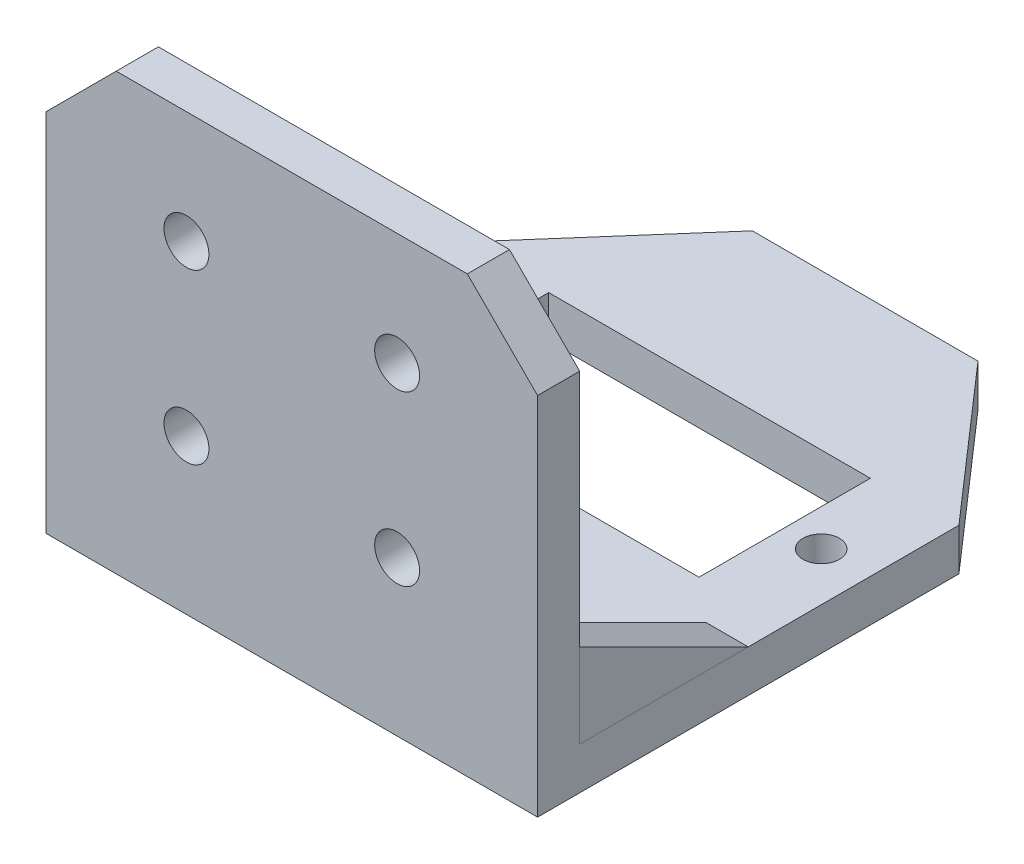
ISO-10303-21;
HEADER;
FILE_DESCRIPTION(('STEP AP214'),'2;1');
FILE_NAME('part.step','',(''),(''),'','','');
FILE_SCHEMA(('AUTOMOTIVE_DESIGN { 1 0 10303 214 1 1 1 1 }'));
ENDSEC;
DATA;
#1=APPLICATION_CONTEXT('core data for automotive mechanical design processes');
#2=APPLICATION_PROTOCOL_DEFINITION('international standard','automotive_design',2000,#1);
#3=PRODUCT_CONTEXT('',#1,'mechanical');
#4=PRODUCT('Part','Part','',(#3));
#5=PRODUCT_RELATED_PRODUCT_CATEGORY('part','',(#4));
#6=PRODUCT_DEFINITION_FORMATION('','',#4);
#7=PRODUCT_DEFINITION_CONTEXT('part definition',#1,'design');
#8=PRODUCT_DEFINITION('design','',#6,#7);
#9=PRODUCT_DEFINITION_SHAPE('','',#8);
#10=(LENGTH_UNIT() NAMED_UNIT(*) SI_UNIT(.MILLI.,.METRE.));
#11=(NAMED_UNIT(*) PLANE_ANGLE_UNIT() SI_UNIT($,.RADIAN.));
#12=(NAMED_UNIT(*) SI_UNIT($,.STERADIAN.) SOLID_ANGLE_UNIT());
#13=UNCERTAINTY_MEASURE_WITH_UNIT(LENGTH_MEASURE(1.E-05),#10,'distance_accuracy_value','');
#14=(GEOMETRIC_REPRESENTATION_CONTEXT(3) GLOBAL_UNCERTAINTY_ASSIGNED_CONTEXT((#13)) GLOBAL_UNIT_ASSIGNED_CONTEXT((#10,
#11,#12)) REPRESENTATION_CONTEXT('',''));
#15=CARTESIAN_POINT('',(0.,0.,0.));
#16=DIRECTION('',(0.,0.,1.));
#17=DIRECTION('',(1.,0.,0.));
#18=AXIS2_PLACEMENT_3D('',#15,#16,#17);
#19=CARTESIAN_POINT('',(-18.2810708538972,9.,75.6746229054878));
#20=DIRECTION('',(0.,-0.894427190999916,0.447213595499958));
#21=DIRECTION('',(0.,-0.447213595499958,-0.894427190999916));
#22=AXIS2_PLACEMENT_3D('',#19,#20,#21);
#23=PLANE('',#22);
#24=DIRECTION('',(0.,-0.447213595499958,-0.894427190999916));
#25=VECTOR('',#24,1.);
#26=CARTESIAN_POINT('',(-15.2810708538972,9.,75.6746229054878));
#27=LINE('',#26,#25);
#28=CARTESIAN_POINT('',(-15.2810708538972,9.,75.6746229054878));
#29=VERTEX_POINT('',#28);
#30=CARTESIAN_POINT('',(-15.2810708538972,3.,63.6746229054878));
#31=VERTEX_POINT('',#30);
#32=EDGE_CURVE('E92',#29,#31,#27,.T.);
#33=ORIENTED_EDGE('',*,*,#32,.T.);
#34=DIRECTION('',(1.,0.,0.));
#35=VECTOR('',#34,1.);
#36=CARTESIAN_POINT('',(-18.2810708538972,3.,63.6746229054878));
#37=LINE('',#36,#35);
#38=CARTESIAN_POINT('',(-18.2810708538972,3.,63.6746229054878));
#39=VERTEX_POINT('',#38);
#40=EDGE_CURVE('E12',#39,#31,#37,.T.);
#41=ORIENTED_EDGE('',*,*,#40,.F.);
#42=DIRECTION('',(0.,-0.447213595499958,-0.894427190999916));
#43=VECTOR('',#42,1.);
#44=CARTESIAN_POINT('',(-18.2810708538972,9.,75.6746229054878));
#45=LINE('',#44,#43);
#46=CARTESIAN_POINT('',(-18.2810708538972,9.,75.6746229054878));
#47=VERTEX_POINT('',#46);
#48=EDGE_CURVE('E85',#47,#39,#45,.T.);
#49=ORIENTED_EDGE('',*,*,#48,.F.);
#50=DIRECTION('',(1.,0.,0.));
#51=VECTOR('',#50,1.);
#52=CARTESIAN_POINT('',(-18.2810708538972,9.,75.6746229054878));
#53=LINE('',#52,#51);
#54=EDGE_CURVE('E93',#47,#29,#53,.T.);
#55=ORIENTED_EDGE('',*,*,#54,.T.);
#56=EDGE_LOOP('',(#33,#41,#49,#55));
#57=FACE_BOUND('',#56,.T.);
#58=ADVANCED_FACE('F45',(#57),#23,.F.);
#59=CARTESIAN_POINT('',(-18.2810708538972,3.,75.6746229054878));
#60=DIRECTION('',(0.,1.,0.));
#61=DIRECTION('',(0.,0.,1.));
#62=AXIS2_PLACEMENT_3D('',#59,#60,#61);
#63=PLANE('',#62);
#64=DIRECTION('',(0.,0.,1.));
#65=VECTOR('',#64,1.);
#66=CARTESIAN_POINT('',(-15.2810708538972,3.,75.6746229054878));
#67=LINE('',#66,#65);
#68=CARTESIAN_POINT('',(-15.2810708538972,3.,75.6746229054878));
#69=VERTEX_POINT('',#68);
#70=EDGE_CURVE('E73',#31,#69,#67,.T.);
#71=ORIENTED_EDGE('',*,*,#70,.T.);
#72=DIRECTION('',(1.,0.,0.));
#73=VECTOR('',#72,1.);
#74=CARTESIAN_POINT('',(-18.2810708538972,3.,75.6746229054878));
#75=LINE('',#74,#73);
#76=CARTESIAN_POINT('',(-18.2810708538972,3.,75.6746229054878));
#77=VERTEX_POINT('',#76);
#78=EDGE_CURVE('E53',#77,#69,#75,.T.);
#79=ORIENTED_EDGE('',*,*,#78,.F.);
#80=DIRECTION('',(0.,0.,1.));
#81=VECTOR('',#80,1.);
#82=CARTESIAN_POINT('',(-18.2810708538972,3.,75.6746229054878));
#83=LINE('',#82,#81);
#84=EDGE_CURVE('E81',#39,#77,#83,.T.);
#85=ORIENTED_EDGE('',*,*,#84,.F.);
#86=ORIENTED_EDGE('',*,*,#40,.T.);
#87=EDGE_LOOP('',(#71,#79,#85,#86));
#88=FACE_BOUND('',#87,.T.);
#89=ADVANCED_FACE('F82',(#88),#63,.F.);
#90=CARTESIAN_POINT('',(-18.2810708538972,3.,75.6746229054878));
#91=DIRECTION('',(0.,0.,-1.));
#92=DIRECTION('',(-1.,0.,0.));
#93=AXIS2_PLACEMENT_3D('',#90,#91,#92);
#94=PLANE('',#93);
#95=DIRECTION('',(0.,1.,0.));
#96=VECTOR('',#95,1.);
#97=CARTESIAN_POINT('',(-15.2810708538972,3.,75.6746229054878));
#98=LINE('',#97,#96);
#99=EDGE_CURVE('E78',#69,#29,#98,.T.);
#100=ORIENTED_EDGE('',*,*,#99,.T.);
#101=ORIENTED_EDGE('',*,*,#54,.F.);
#102=DIRECTION('',(0.,1.,0.));
#103=VECTOR('',#102,1.);
#104=CARTESIAN_POINT('',(-18.2810708538972,3.,75.6746229054878));
#105=LINE('',#104,#103);
#106=EDGE_CURVE('E61',#77,#47,#105,.T.);
#107=ORIENTED_EDGE('',*,*,#106,.F.);
#108=ORIENTED_EDGE('',*,*,#78,.T.);
#109=EDGE_LOOP('',(#100,#101,#107,#108));
#110=FACE_BOUND('',#109,.T.);
#111=ADVANCED_FACE('F100',(#110),#94,.F.);
#112=CARTESIAN_POINT('',(-18.2810708538972,0.,0.));
#113=DIRECTION('',(1.,0.,0.));
#114=DIRECTION('',(0.,0.,-1.));
#115=AXIS2_PLACEMENT_3D('',#112,#113,#114);
#116=PLANE('',#115);
#117=ORIENTED_EDGE('',*,*,#48,.T.);
#118=ORIENTED_EDGE('',*,*,#84,.T.);
#119=ORIENTED_EDGE('',*,*,#106,.T.);
#120=EDGE_LOOP('',(#117,#118,#119));
#121=FACE_BOUND('',#120,.T.);
#122=ADVANCED_FACE('F88',(#121),#116,.F.);
#123=CARTESIAN_POINT('',(-15.2810708538972,0.,0.));
#124=DIRECTION('',(1.,0.,0.));
#125=DIRECTION('',(0.,0.,-1.));
#126=AXIS2_PLACEMENT_3D('',#123,#124,#125);
#127=PLANE('',#126);
#128=ORIENTED_EDGE('',*,*,#32,.F.);
#129=ORIENTED_EDGE('',*,*,#99,.F.);
#130=ORIENTED_EDGE('',*,*,#70,.F.);
#131=EDGE_LOOP('',(#128,#129,#130));
#132=FACE_BOUND('',#131,.T.);
#133=ADVANCED_FACE('F101',(#132),#127,.T.);
#134=CLOSED_SHELL('',(#58,#89,#111,#122,#133));
#135=MANIFOLD_SOLID_BREP('B2',#134);
#136=CARTESIAN_POINT('',(-47.2760190236479,3.,63.6746229054878));
#137=DIRECTION('',(0.,-0.894427190999916,0.447213595499958));
#138=DIRECTION('',(0.,-0.447213595499958,-0.894427190999916));
#139=AXIS2_PLACEMENT_3D('',#136,#137,#138);
#140=PLANE('',#139);
#141=DIRECTION('',(0.,0.447213595499958,0.894427190999916));
#142=VECTOR('',#141,1.);
#143=CARTESIAN_POINT('',(-50.2760190236479,3.,63.6746229054878));
#144=LINE('',#143,#142);
#145=CARTESIAN_POINT('',(-50.2760190236479,3.,63.6746229054878));
#146=VERTEX_POINT('',#145);
#147=CARTESIAN_POINT('',(-50.2760190236479,9.,75.6746229054878));
#148=VERTEX_POINT('',#147);
#149=EDGE_CURVE('E199',#146,#148,#144,.T.);
#150=ORIENTED_EDGE('',*,*,#149,.T.);
#151=DIRECTION('',(-1.,0.,0.));
#152=VECTOR('',#151,1.);
#153=CARTESIAN_POINT('',(-47.2760190236479,9.,75.6746229054878));
#154=LINE('',#153,#152);
#155=CARTESIAN_POINT('',(-47.2760190236479,9.,75.6746229054878));
#156=VERTEX_POINT('',#155);
#157=EDGE_CURVE('E43',#156,#148,#154,.T.);
#158=ORIENTED_EDGE('',*,*,#157,.F.);
#159=DIRECTION('',(0.,0.447213595499958,0.894427190999916));
#160=VECTOR('',#159,1.);
#161=CARTESIAN_POINT('',(-47.2760190236479,3.,63.6746229054878));
#162=LINE('',#161,#160);
#163=CARTESIAN_POINT('',(-47.2760190236479,3.,63.6746229054878));
#164=VERTEX_POINT('',#163);
#165=EDGE_CURVE('E192',#164,#156,#162,.T.);
#166=ORIENTED_EDGE('',*,*,#165,.F.);
#167=DIRECTION('',(-1.,0.,0.));
#168=VECTOR('',#167,1.);
#169=CARTESIAN_POINT('',(-47.2760190236479,3.,63.6746229054878));
#170=LINE('',#169,#168);
#171=EDGE_CURVE('E200',#164,#146,#170,.T.);
#172=ORIENTED_EDGE('',*,*,#171,.T.);
#173=EDGE_LOOP('',(#150,#158,#166,#172));
#174=FACE_BOUND('',#173,.T.);
#175=ADVANCED_FACE('F152',(#174),#140,.F.);
#176=CARTESIAN_POINT('',(-47.2760190236479,3.,75.6746229054878));
#177=DIRECTION('',(0.,0.,-1.));
#178=DIRECTION('',(-1.,0.,0.));
#179=AXIS2_PLACEMENT_3D('',#176,#177,#178);
#180=PLANE('',#179);
#181=DIRECTION('',(0.,-1.,0.));
#182=VECTOR('',#181,1.);
#183=CARTESIAN_POINT('',(-50.2760190236479,3.,75.6746229054878));
#184=LINE('',#183,#182);
#185=CARTESIAN_POINT('',(-50.2760190236479,3.,75.6746229054878));
#186=VERTEX_POINT('',#185);
#187=EDGE_CURVE('E180',#148,#186,#184,.T.);
#188=ORIENTED_EDGE('',*,*,#187,.T.);
#189=DIRECTION('',(-1.,0.,0.));
#190=VECTOR('',#189,1.);
#191=CARTESIAN_POINT('',(-47.2760190236479,3.,75.6746229054878));
#192=LINE('',#191,#190);
#193=CARTESIAN_POINT('',(-47.2760190236479,3.,75.6746229054878));
#194=VERTEX_POINT('',#193);
#195=EDGE_CURVE('E160',#194,#186,#192,.T.);
#196=ORIENTED_EDGE('',*,*,#195,.F.);
#197=DIRECTION('',(0.,-1.,0.));
#198=VECTOR('',#197,1.);
#199=CARTESIAN_POINT('',(-47.2760190236479,3.,75.6746229054878));
#200=LINE('',#199,#198);
#201=EDGE_CURVE('E188',#156,#194,#200,.T.);
#202=ORIENTED_EDGE('',*,*,#201,.F.);
#203=ORIENTED_EDGE('',*,*,#157,.T.);
#204=EDGE_LOOP('',(#188,#196,#202,#203));
#205=FACE_BOUND('',#204,.T.);
#206=ADVANCED_FACE('F189',(#205),#180,.F.);
#207=CARTESIAN_POINT('',(-47.2760190236479,3.,75.6746229054878));
#208=DIRECTION('',(0.,1.,0.));
#209=DIRECTION('',(0.,0.,1.));
#210=AXIS2_PLACEMENT_3D('',#207,#208,#209);
#211=PLANE('',#210);
#212=DIRECTION('',(0.,0.,-1.));
#213=VECTOR('',#212,1.);
#214=CARTESIAN_POINT('',(-50.2760190236479,3.,75.6746229054878));
#215=LINE('',#214,#213);
#216=EDGE_CURVE('E185',#186,#146,#215,.T.);
#217=ORIENTED_EDGE('',*,*,#216,.T.);
#218=ORIENTED_EDGE('',*,*,#171,.F.);
#219=DIRECTION('',(0.,0.,-1.));
#220=VECTOR('',#219,1.);
#221=CARTESIAN_POINT('',(-47.2760190236479,3.,75.6746229054878));
#222=LINE('',#221,#220);
#223=EDGE_CURVE('E168',#194,#164,#222,.T.);
#224=ORIENTED_EDGE('',*,*,#223,.F.);
#225=ORIENTED_EDGE('',*,*,#195,.T.);
#226=EDGE_LOOP('',(#217,#218,#224,#225));
#227=FACE_BOUND('',#226,.T.);
#228=ADVANCED_FACE('F207',(#227),#211,.F.);
#229=CARTESIAN_POINT('',(-47.2760190236479,0.,0.));
#230=DIRECTION('',(-1.,0.,0.));
#231=DIRECTION('',(0.,0.,1.));
#232=AXIS2_PLACEMENT_3D('',#229,#230,#231);
#233=PLANE('',#232);
#234=ORIENTED_EDGE('',*,*,#165,.T.);
#235=ORIENTED_EDGE('',*,*,#201,.T.);
#236=ORIENTED_EDGE('',*,*,#223,.T.);
#237=EDGE_LOOP('',(#234,#235,#236));
#238=FACE_BOUND('',#237,.T.);
#239=ADVANCED_FACE('F195',(#238),#233,.F.);
#240=CARTESIAN_POINT('',(-50.2760190236479,0.,0.));
#241=DIRECTION('',(-1.,0.,0.));
#242=DIRECTION('',(0.,0.,1.));
#243=AXIS2_PLACEMENT_3D('',#240,#241,#242);
#244=PLANE('',#243);
#245=ORIENTED_EDGE('',*,*,#149,.F.);
#246=ORIENTED_EDGE('',*,*,#216,.F.);
#247=ORIENTED_EDGE('',*,*,#187,.F.);
#248=EDGE_LOOP('',(#245,#246,#247));
#249=FACE_BOUND('',#248,.T.);
#250=ADVANCED_FACE('F208',(#249),#244,.T.);
#251=CLOSED_SHELL('',(#175,#206,#228,#239,#250));
#252=MANIFOLD_SOLID_BREP('B6',#251);
#253=CARTESIAN_POINT('',(0.,3.,0.));
#254=DIRECTION('',(0.,-1.,0.));
#255=DIRECTION('',(0.,0.,-1.));
#256=AXIS2_PLACEMENT_3D('',#253,#254,#255);
#257=PLANE('',#256);
#258=CARTESIAN_POINT('',(-18.7310708538972,3.,55.0306271703624));
#259=DIRECTION('',(0.,1.,0.));
#260=DIRECTION('',(0.,0.,1.));
#261=AXIS2_PLACEMENT_3D('',#258,#259,#260);
#262=CIRCLE('',#261,1.3);
#263=CARTESIAN_POINT('',(-18.7310708538972,3.,56.3306271703624));
#264=VERTEX_POINT('',#263);
#265=EDGE_CURVE('E386',#264,#264,#262,.T.);
#266=ORIENTED_EDGE('',*,*,#265,.F.);
#267=EDGE_LOOP('',(#266));
#268=FACE_BOUND('',#267,.T.);
#269=CARTESIAN_POINT('',(-46.7310708538972,3.,55.0306271703624));
#270=DIRECTION('',(0.,1.,0.));
#271=DIRECTION('',(0.,0.,1.));
#272=AXIS2_PLACEMENT_3D('',#269,#270,#271);
#273=CIRCLE('',#272,1.3);
#274=CARTESIAN_POINT('',(-46.7310708538972,3.,56.3306271703624));
#275=VERTEX_POINT('',#274);
#276=EDGE_CURVE('E392',#275,#275,#273,.T.);
#277=ORIENTED_EDGE('',*,*,#276,.F.);
#278=EDGE_LOOP('',(#277));
#279=FACE_BOUND('',#278,.T.);
#280=DIRECTION('',(0.,0.,-1.));
#281=VECTOR('',#280,1.);
#282=CARTESIAN_POINT('',(-21.3310708538972,3.,48.9306271703624));
#283=LINE('',#282,#281);
#284=CARTESIAN_POINT('',(-21.3310708538972,3.,61.1306271703624));
#285=VERTEX_POINT('',#284);
#286=CARTESIAN_POINT('',(-21.3310708538972,3.,48.9306271703624));
#287=VERTEX_POINT('',#286);
#288=EDGE_CURVE('E398',#285,#287,#283,.T.);
#289=ORIENTED_EDGE('',*,*,#288,.F.);
#290=DIRECTION('',(1.,0.,0.));
#291=VECTOR('',#290,1.);
#292=CARTESIAN_POINT('',(-21.3310708538972,3.,61.1306271703624));
#293=LINE('',#292,#291);
#294=CARTESIAN_POINT('',(-44.2310708538972,3.,61.1306271703624));
#295=VERTEX_POINT('',#294);
#296=EDGE_CURVE('E406',#295,#285,#293,.T.);
#297=ORIENTED_EDGE('',*,*,#296,.F.);
#298=DIRECTION('',(0.,0.,1.));
#299=VECTOR('',#298,1.);
#300=CARTESIAN_POINT('',(-44.2310708538972,3.,48.9306271703624));
#301=LINE('',#300,#299);
#302=CARTESIAN_POINT('',(-44.2310708538972,3.,48.9306271703624));
#303=VERTEX_POINT('',#302);
#304=EDGE_CURVE('E403',#303,#295,#301,.T.);
#305=ORIENTED_EDGE('',*,*,#304,.F.);
#306=DIRECTION('',(-1.,0.,0.));
#307=VECTOR('',#306,1.);
#308=CARTESIAN_POINT('',(-21.3310708538972,3.,48.9306271703624));
#309=LINE('',#308,#307);
#310=EDGE_CURVE('E400',#287,#303,#309,.T.);
#311=ORIENTED_EDGE('',*,*,#310,.F.);
#312=EDGE_LOOP('',(#289,#297,#305,#311));
#313=FACE_BOUND('',#312,.T.);
#314=DIRECTION('',(-1.,0.,0.));
#315=VECTOR('',#314,1.);
#316=CARTESIAN_POINT('',(-50.2810708538972,3.,75.6746229054878));
#317=LINE('',#316,#315);
#318=CARTESIAN_POINT('',(-15.2810708538972,3.,75.6746229054878));
#319=VERTEX_POINT('',#318);
#320=CARTESIAN_POINT('',(-50.2760190236479,3.,75.6746229054878));
#321=VERTEX_POINT('',#320);
#322=EDGE_CURVE('E476',#319,#321,#317,.T.);
#323=ORIENTED_EDGE('',*,*,#322,.F.);
#324=DIRECTION('',(0.,0.,-1.));
#325=VECTOR('',#324,1.);
#326=CARTESIAN_POINT('',(-15.2810708538972,3.,48.6746229054878));
#327=LINE('',#326,#325);
#328=CARTESIAN_POINT('',(-15.2810708538972,3.,48.6746229054878));
#329=VERTEX_POINT('',#328);
#330=EDGE_CURVE('E377',#319,#329,#327,.T.);
#331=ORIENTED_EDGE('',*,*,#330,.T.);
#332=DIRECTION('',(-0.658154991081228,0.,-0.752882466069485));
#333=VECTOR('',#332,1.);
#334=CARTESIAN_POINT('',(-24.7222176782957,3.,37.8746229054878));
#335=LINE('',#334,#333);
#336=CARTESIAN_POINT('',(-24.7222176782957,3.,37.8746229054878));
#337=VERTEX_POINT('',#336);
#338=EDGE_CURVE('E433',#329,#337,#335,.T.);
#339=ORIENTED_EDGE('',*,*,#338,.T.);
#340=DIRECTION('',(-1.,0.,0.));
#341=VECTOR('',#340,1.);
#342=CARTESIAN_POINT('',(-24.7222176782957,3.,37.8746229054878));
#343=LINE('',#342,#341);
#344=CARTESIAN_POINT('',(-40.7894544557415,3.,37.8746229054878));
#345=VERTEX_POINT('',#344);
#346=EDGE_CURVE('E435',#337,#345,#343,.T.);
#347=ORIENTED_EDGE('',*,*,#346,.T.);
#348=DIRECTION('',(-0.65815159912898,0.,0.752885431233708));
#349=VECTOR('',#348,1.);
#350=CARTESIAN_POINT('',(-50.230552623031,3.,48.6746654403788));
#351=LINE('',#350,#349);
#352=CARTESIAN_POINT('',(-50.230552623031,3.,48.6746654403788));
#353=VERTEX_POINT('',#352);
#354=EDGE_CURVE('E437',#345,#353,#351,.T.);
#355=ORIENTED_EDGE('',*,*,#354,.T.);
#356=DIRECTION('',(-0.00168394102887381,0.,0.999998582170301));
#357=VECTOR('',#356,1.);
#358=CARTESIAN_POINT('',(-50.230552623031,3.,48.6746654403788));
#359=LINE('',#358,#357);
#360=EDGE_CURVE('E429',#353,#321,#359,.T.);
#361=ORIENTED_EDGE('',*,*,#360,.T.);
#362=EDGE_LOOP('',(#323,#331,#339,#347,#355,#361));
#363=FACE_BOUND('',#362,.T.);
#364=ADVANCED_FACE('F251',(#268,#279,#313,#363),#257,.F.);
#365=CARTESIAN_POINT('',(0.,0.,0.));
#366=DIRECTION('',(0.,-1.,0.));
#367=DIRECTION('',(0.,0.,-1.));
#368=AXIS2_PLACEMENT_3D('',#365,#366,#367);
#369=PLANE('',#368);
#370=CARTESIAN_POINT('',(-46.7310708538972,0.,55.0306271703624));
#371=DIRECTION('',(0.,1.,0.));
#372=DIRECTION('',(0.,0.,1.));
#373=AXIS2_PLACEMENT_3D('',#370,#371,#372);
#374=CIRCLE('',#373,1.3);
#375=CARTESIAN_POINT('',(-46.7310708538972,0.,56.3306271703624));
#376=VERTEX_POINT('',#375);
#377=EDGE_CURVE('E389',#376,#376,#374,.T.);
#378=ORIENTED_EDGE('',*,*,#377,.T.);
#379=EDGE_LOOP('',(#378));
#380=FACE_BOUND('',#379,.T.);
#381=DIRECTION('',(-0.00168394102887381,0.,0.999998582170301));
#382=VECTOR('',#381,1.);
#383=CARTESIAN_POINT('',(-50.230552623031,0.,48.6746654403788));
#384=LINE('',#383,#382);
#385=CARTESIAN_POINT('',(-50.230552623031,0.,48.6746654403788));
#386=VERTEX_POINT('',#385);
#387=CARTESIAN_POINT('',(-50.2810708538972,0.,78.6746229054878));
#388=VERTEX_POINT('',#387);
#389=EDGE_CURVE('E428',#386,#388,#384,.T.);
#390=ORIENTED_EDGE('',*,*,#389,.F.);
#391=DIRECTION('',(-0.65815159912898,0.,0.752885431233708));
#392=VECTOR('',#391,1.);
#393=CARTESIAN_POINT('',(-50.230552623031,0.,48.6746654403788));
#394=LINE('',#393,#392);
#395=CARTESIAN_POINT('',(-40.7894544557415,0.,37.8746229054878));
#396=VERTEX_POINT('',#395);
#397=EDGE_CURVE('E451',#396,#386,#394,.T.);
#398=ORIENTED_EDGE('',*,*,#397,.F.);
#399=DIRECTION('',(-1.,0.,0.));
#400=VECTOR('',#399,1.);
#401=CARTESIAN_POINT('',(-24.7222176782957,0.,37.8746229054878));
#402=LINE('',#401,#400);
#403=CARTESIAN_POINT('',(-24.7222176782957,0.,37.8746229054878));
#404=VERTEX_POINT('',#403);
#405=EDGE_CURVE('E449',#404,#396,#402,.T.);
#406=ORIENTED_EDGE('',*,*,#405,.F.);
#407=DIRECTION('',(-0.658154991081228,0.,-0.752882466069485));
#408=VECTOR('',#407,1.);
#409=CARTESIAN_POINT('',(-24.7222176782957,0.,37.8746229054878));
#410=LINE('',#409,#408);
#411=CARTESIAN_POINT('',(-15.2810708538972,0.,48.6746229054878));
#412=VERTEX_POINT('',#411);
#413=EDGE_CURVE('E447',#412,#404,#410,.T.);
#414=ORIENTED_EDGE('',*,*,#413,.F.);
#415=DIRECTION('',(0.,0.,-1.));
#416=VECTOR('',#415,1.);
#417=CARTESIAN_POINT('',(-15.2810708538972,0.,48.6746229054878));
#418=LINE('',#417,#416);
#419=CARTESIAN_POINT('',(-15.2810708538972,0.,78.6746229054878));
#420=VERTEX_POINT('',#419);
#421=EDGE_CURVE('E445',#420,#412,#418,.T.);
#422=ORIENTED_EDGE('',*,*,#421,.F.);
#423=DIRECTION('',(1.,0.,0.));
#424=VECTOR('',#423,1.);
#425=CARTESIAN_POINT('',(-15.2810708538972,0.,78.6746229054878));
#426=LINE('',#425,#424);
#427=EDGE_CURVE('E442',#388,#420,#426,.T.);
#428=ORIENTED_EDGE('',*,*,#427,.F.);
#429=EDGE_LOOP('',(#390,#398,#406,#414,#422,#428));
#430=FACE_BOUND('',#429,.T.);
#431=DIRECTION('',(1.,0.,0.));
#432=VECTOR('',#431,1.);
#433=CARTESIAN_POINT('',(-21.3310708538972,0.,61.1306271703624));
#434=LINE('',#433,#432);
#435=CARTESIAN_POINT('',(-44.2310708538972,0.,61.1306271703624));
#436=VERTEX_POINT('',#435);
#437=CARTESIAN_POINT('',(-21.3310708538972,0.,61.1306271703624));
#438=VERTEX_POINT('',#437);
#439=EDGE_CURVE('E401',#436,#438,#434,.T.);
#440=ORIENTED_EDGE('',*,*,#439,.T.);
#441=DIRECTION('',(0.,0.,-1.));
#442=VECTOR('',#441,1.);
#443=CARTESIAN_POINT('',(-21.3310708538972,0.,48.9306271703624));
#444=LINE('',#443,#442);
#445=CARTESIAN_POINT('',(-21.3310708538972,0.,48.9306271703624));
#446=VERTEX_POINT('',#445);
#447=EDGE_CURVE('E395',#438,#446,#444,.T.);
#448=ORIENTED_EDGE('',*,*,#447,.T.);
#449=DIRECTION('',(-1.,0.,0.));
#450=VECTOR('',#449,1.);
#451=CARTESIAN_POINT('',(-21.3310708538972,0.,48.9306271703624));
#452=LINE('',#451,#450);
#453=CARTESIAN_POINT('',(-44.2310708538972,0.,48.9306271703624));
#454=VERTEX_POINT('',#453);
#455=EDGE_CURVE('E411',#446,#454,#452,.T.);
#456=ORIENTED_EDGE('',*,*,#455,.T.);
#457=DIRECTION('',(0.,0.,1.));
#458=VECTOR('',#457,1.);
#459=CARTESIAN_POINT('',(-44.2310708538972,0.,48.9306271703624));
#460=LINE('',#459,#458);
#461=EDGE_CURVE('E414',#454,#436,#460,.T.);
#462=ORIENTED_EDGE('',*,*,#461,.T.);
#463=EDGE_LOOP('',(#440,#448,#456,#462));
#464=FACE_BOUND('',#463,.T.);
#465=CARTESIAN_POINT('',(-18.7310708538972,0.,55.0306271703624));
#466=DIRECTION('',(0.,1.,0.));
#467=DIRECTION('',(0.,0.,1.));
#468=AXIS2_PLACEMENT_3D('',#465,#466,#467);
#469=CIRCLE('',#468,1.3);
#470=CARTESIAN_POINT('',(-18.7310708538972,0.,56.3306271703624));
#471=VERTEX_POINT('',#470);
#472=EDGE_CURVE('E381',#471,#471,#469,.T.);
#473=ORIENTED_EDGE('',*,*,#472,.T.);
#474=EDGE_LOOP('',(#473));
#475=FACE_BOUND('',#474,.T.);
#476=ADVANCED_FACE('F546',(#380,#430,#464,#475),#369,.T.);
#477=CARTESIAN_POINT('',(-50.230552623031,3.,48.6746654403788));
#478=DIRECTION('',(0.9999985821703,0.,0.00168394102887381));
#479=DIRECTION('',(0.00168394102887381,0.,-0.999998582170301));
#480=AXIS2_PLACEMENT_3D('',#477,#478,#479);
#481=PLANE('',#480);
#482=ORIENTED_EDGE('',*,*,#389,.T.);
#483=DIRECTION('',(0.,-1.,0.));
#484=VECTOR('',#483,1.);
#485=CARTESIAN_POINT('',(-50.2810708538972,3.,78.6746229054878));
#486=LINE('',#485,#484);
#487=CARTESIAN_POINT('',(-50.2810708538972,3.,78.6746229054878));
#488=VERTEX_POINT('',#487);
#489=EDGE_CURVE('E466',#488,#388,#486,.T.);
#490=ORIENTED_EDGE('',*,*,#489,.F.);
#491=EDGE_CURVE('E431',#321,#488,#359,.T.);
#492=ORIENTED_EDGE('',*,*,#491,.F.);
#493=ORIENTED_EDGE('',*,*,#360,.F.);
#494=DIRECTION('',(0.,-1.,0.));
#495=VECTOR('',#494,1.);
#496=CARTESIAN_POINT('',(-50.230552623031,3.,48.6746654403788));
#497=LINE('',#496,#495);
#498=EDGE_CURVE('E439',#353,#386,#497,.T.);
#499=ORIENTED_EDGE('',*,*,#498,.T.);
#500=EDGE_LOOP('',(#482,#490,#492,#493,#499));
#501=FACE_BOUND('',#500,.T.);
#502=ADVANCED_FACE('F253',(#501),#481,.F.);
#503=CARTESIAN_POINT('',(-15.2810708538972,3.,78.6746229054878));
#504=DIRECTION('',(0.,0.,-1.));
#505=DIRECTION('',(-1.,0.,0.));
#506=AXIS2_PLACEMENT_3D('',#503,#504,#505);
#507=PLANE('',#506);
#508=CARTESIAN_POINT('',(-25.2810708538972,23.,78.6746229054878));
#509=DIRECTION('',(0.,0.,-1.));
#510=DIRECTION('',(-1.,0.,0.));
#511=AXIS2_PLACEMENT_3D('',#508,#509,#510);
#512=CIRCLE('',#511,1.6);
#513=CARTESIAN_POINT('',(-26.8810708538972,23.,78.6746229054878));
#514=VERTEX_POINT('',#513);
#515=EDGE_CURVE('E511',#514,#514,#512,.T.);
#516=ORIENTED_EDGE('',*,*,#515,.T.);
#517=EDGE_LOOP('',(#516));
#518=FACE_BOUND('',#517,.T.);
#519=CARTESIAN_POINT('',(-40.2810708538972,23.,78.6746229054878));
#520=DIRECTION('',(0.,0.,-1.));
#521=DIRECTION('',(-1.,0.,0.));
#522=AXIS2_PLACEMENT_3D('',#519,#520,#521);
#523=CIRCLE('',#522,1.6);
#524=CARTESIAN_POINT('',(-41.8810708538972,23.,78.6746229054878));
#525=VERTEX_POINT('',#524);
#526=EDGE_CURVE('E505',#525,#525,#523,.T.);
#527=ORIENTED_EDGE('',*,*,#526,.T.);
#528=EDGE_LOOP('',(#527));
#529=FACE_BOUND('',#528,.T.);
#530=CARTESIAN_POINT('',(-40.2810708538972,11.,78.6746229054878));
#531=DIRECTION('',(0.,0.,-1.));
#532=DIRECTION('',(-1.,0.,0.));
#533=AXIS2_PLACEMENT_3D('',#530,#531,#532);
#534=CIRCLE('',#533,1.6);
#535=CARTESIAN_POINT('',(-41.8810708538972,11.,78.6746229054878));
#536=VERTEX_POINT('',#535);
#537=EDGE_CURVE('E499',#536,#536,#534,.T.);
#538=ORIENTED_EDGE('',*,*,#537,.T.);
#539=EDGE_LOOP('',(#538));
#540=FACE_BOUND('',#539,.T.);
#541=CARTESIAN_POINT('',(-25.2810708538972,11.,78.6746229054878));
#542=DIRECTION('',(0.,0.,-1.));
#543=DIRECTION('',(-1.,0.,0.));
#544=AXIS2_PLACEMENT_3D('',#541,#542,#543);
#545=CIRCLE('',#544,1.6);
#546=CARTESIAN_POINT('',(-26.8810708538972,11.,78.6746229054878));
#547=VERTEX_POINT('',#546);
#548=EDGE_CURVE('E492',#547,#547,#545,.T.);
#549=ORIENTED_EDGE('',*,*,#548,.T.);
#550=EDGE_LOOP('',(#549));
#551=FACE_BOUND('',#550,.T.);
#552=DIRECTION('',(0.,-1.,0.));
#553=VECTOR('',#552,1.);
#554=CARTESIAN_POINT('',(-15.2810708538972,3.,78.6746229054878));
#555=LINE('',#554,#553);
#556=CARTESIAN_POINT('',(-15.2810708538972,26.,78.6746229054878));
#557=VERTEX_POINT('',#556);
#558=EDGE_CURVE('E464',#557,#420,#555,.T.);
#559=ORIENTED_EDGE('',*,*,#558,.F.);
#560=DIRECTION('',(-0.707106781186548,0.707106781186548,0.));
#561=VECTOR('',#560,1.);
#562=CARTESIAN_POINT('',(-3.78107085389719,14.5,78.6746229054878));
#563=LINE('',#562,#561);
#564=CARTESIAN_POINT('',(-20.2810708538972,31.,78.6746229054878));
#565=VERTEX_POINT('',#564);
#566=EDGE_CURVE('E358',#557,#565,#563,.T.);
#567=ORIENTED_EDGE('',*,*,#566,.T.);
#568=DIRECTION('',(1.,0.,0.));
#569=VECTOR('',#568,1.);
#570=CARTESIAN_POINT('',(-50.2810708538972,31.,78.6746229054878));
#571=LINE('',#570,#569);
#572=CARTESIAN_POINT('',(-45.2810708538972,31.,78.6746229054878));
#573=VERTEX_POINT('',#572);
#574=EDGE_CURVE('E472',#573,#565,#571,.T.);
#575=ORIENTED_EDGE('',*,*,#574,.F.);
#576=DIRECTION('',(-0.707106781186548,-0.707106781186547,0.));
#577=VECTOR('',#576,1.);
#578=CARTESIAN_POINT('',(-44.2810708538972,32.,78.6746229054878));
#579=LINE('',#578,#577);
#580=CARTESIAN_POINT('',(-50.2810708538972,26.,78.6746229054878));
#581=VERTEX_POINT('',#580);
#582=EDGE_CURVE('E273',#573,#581,#579,.T.);
#583=ORIENTED_EDGE('',*,*,#582,.T.);
#584=DIRECTION('',(0.,-1.,0.));
#585=VECTOR('',#584,1.);
#586=CARTESIAN_POINT('',(-50.2810708538972,31.,78.6746229054878));
#587=LINE('',#586,#585);
#588=EDGE_CURVE('E378',#581,#488,#587,.T.);
#589=ORIENTED_EDGE('',*,*,#588,.T.);
#590=ORIENTED_EDGE('',*,*,#489,.T.);
#591=ORIENTED_EDGE('',*,*,#427,.T.);
#592=EDGE_LOOP('',(#559,#567,#575,#583,#589,#590,#591));
#593=FACE_BOUND('',#592,.T.);
#594=ADVANCED_FACE('F474',(#518,#529,#540,#551,#593),#507,.F.);
#595=CARTESIAN_POINT('',(-15.2810708538972,3.,48.6746229054878));
#596=DIRECTION('',(-1.,0.,0.));
#597=DIRECTION('',(0.,0.,1.));
#598=AXIS2_PLACEMENT_3D('',#595,#596,#597);
#599=PLANE('',#598);
#600=DIRECTION('',(0.,-1.,0.));
#601=VECTOR('',#600,1.);
#602=CARTESIAN_POINT('',(-15.2810708538972,31.,75.6746229054878));
#603=LINE('',#602,#601);
#604=CARTESIAN_POINT('',(-15.2810708538972,26.,75.6746229054878));
#605=VERTEX_POINT('',#604);
#606=EDGE_CURVE('E367',#605,#319,#603,.T.);
#607=ORIENTED_EDGE('',*,*,#606,.F.);
#608=DIRECTION('',(0.,0.,-1.));
#609=VECTOR('',#608,1.);
#610=CARTESIAN_POINT('',(-15.2810708538972,26.,83.6746229054878));
#611=LINE('',#610,#609);
#612=EDGE_CURVE('E355',#557,#605,#611,.T.);
#613=ORIENTED_EDGE('',*,*,#612,.F.);
#614=ORIENTED_EDGE('',*,*,#558,.T.);
#615=ORIENTED_EDGE('',*,*,#421,.T.);
#616=DIRECTION('',(0.,-1.,0.));
#617=VECTOR('',#616,1.);
#618=CARTESIAN_POINT('',(-15.2810708538972,3.,48.6746229054878));
#619=LINE('',#618,#617);
#620=EDGE_CURVE('E461',#329,#412,#619,.T.);
#621=ORIENTED_EDGE('',*,*,#620,.F.);
#622=ORIENTED_EDGE('',*,*,#330,.F.);
#623=EDGE_LOOP('',(#607,#613,#614,#615,#621,#622));
#624=FACE_BOUND('',#623,.T.);
#625=ADVANCED_FACE('F375',(#624),#599,.F.);
#626=CARTESIAN_POINT('',(-24.7222176782957,3.,37.8746229054878));
#627=DIRECTION('',(-0.752882466069485,0.,0.658154991081228));
#628=DIRECTION('',(0.658154991081228,0.,0.752882466069485));
#629=AXIS2_PLACEMENT_3D('',#626,#627,#628);
#630=PLANE('',#629);
#631=ORIENTED_EDGE('',*,*,#413,.T.);
#632=DIRECTION('',(0.,-1.,0.));
#633=VECTOR('',#632,1.);
#634=CARTESIAN_POINT('',(-24.7222176782957,3.,37.8746229054878));
#635=LINE('',#634,#633);
#636=EDGE_CURVE('E458',#337,#404,#635,.T.);
#637=ORIENTED_EDGE('',*,*,#636,.F.);
#638=ORIENTED_EDGE('',*,*,#338,.F.);
#639=ORIENTED_EDGE('',*,*,#620,.T.);
#640=EDGE_LOOP('',(#631,#637,#638,#639));
#641=FACE_BOUND('',#640,.T.);
#642=ADVANCED_FACE('F544',(#641),#630,.F.);
#643=CARTESIAN_POINT('',(-24.7222176782957,3.,37.8746229054878));
#644=DIRECTION('',(0.,0.,1.));
#645=DIRECTION('',(1.,0.,0.));
#646=AXIS2_PLACEMENT_3D('',#643,#644,#645);
#647=PLANE('',#646);
#648=ORIENTED_EDGE('',*,*,#405,.T.);
#649=DIRECTION('',(0.,-1.,0.));
#650=VECTOR('',#649,1.);
#651=CARTESIAN_POINT('',(-40.7894544557415,3.,37.8746229054878));
#652=LINE('',#651,#650);
#653=EDGE_CURVE('E455',#345,#396,#652,.T.);
#654=ORIENTED_EDGE('',*,*,#653,.F.);
#655=ORIENTED_EDGE('',*,*,#346,.F.);
#656=ORIENTED_EDGE('',*,*,#636,.T.);
#657=EDGE_LOOP('',(#648,#654,#655,#656));
#658=FACE_BOUND('',#657,.T.);
#659=ADVANCED_FACE('F566',(#658),#647,.F.);
#660=CARTESIAN_POINT('',(-50.230552623031,3.,48.6746654403788));
#661=DIRECTION('',(0.752885431233708,0.,0.65815159912898));
#662=DIRECTION('',(0.65815159912898,0.,-0.752885431233708));
#663=AXIS2_PLACEMENT_3D('',#660,#661,#662);
#664=PLANE('',#663);
#665=ORIENTED_EDGE('',*,*,#397,.T.);
#666=ORIENTED_EDGE('',*,*,#498,.F.);
#667=ORIENTED_EDGE('',*,*,#354,.F.);
#668=ORIENTED_EDGE('',*,*,#653,.T.);
#669=EDGE_LOOP('',(#665,#666,#667,#668));
#670=FACE_BOUND('',#669,.T.);
#671=ADVANCED_FACE('F563',(#670),#664,.F.);
#672=CARTESIAN_POINT('',(-21.3310708538972,3.,48.9306271703624));
#673=DIRECTION('',(-1.,0.,0.));
#674=DIRECTION('',(0.,0.,1.));
#675=AXIS2_PLACEMENT_3D('',#672,#673,#674);
#676=PLANE('',#675);
#677=ORIENTED_EDGE('',*,*,#447,.F.);
#678=DIRECTION('',(0.,-1.,0.));
#679=VECTOR('',#678,1.);
#680=CARTESIAN_POINT('',(-21.3310708538972,3.,61.1306271703624));
#681=LINE('',#680,#679);
#682=EDGE_CURVE('E408',#285,#438,#681,.T.);
#683=ORIENTED_EDGE('',*,*,#682,.F.);
#684=ORIENTED_EDGE('',*,*,#288,.T.);
#685=DIRECTION('',(0.,-1.,0.));
#686=VECTOR('',#685,1.);
#687=CARTESIAN_POINT('',(-21.3310708538972,3.,48.9306271703624));
#688=LINE('',#687,#686);
#689=EDGE_CURVE('E425',#287,#446,#688,.T.);
#690=ORIENTED_EDGE('',*,*,#689,.T.);
#691=EDGE_LOOP('',(#677,#683,#684,#690));
#692=FACE_BOUND('',#691,.T.);
#693=ADVANCED_FACE('F560',(#692),#676,.T.);
#694=CARTESIAN_POINT('',(-21.3310708538972,3.,48.9306271703624));
#695=DIRECTION('',(0.,0.,1.));
#696=DIRECTION('',(1.,0.,0.));
#697=AXIS2_PLACEMENT_3D('',#694,#695,#696);
#698=PLANE('',#697);
#699=ORIENTED_EDGE('',*,*,#455,.F.);
#700=ORIENTED_EDGE('',*,*,#689,.F.);
#701=ORIENTED_EDGE('',*,*,#310,.T.);
#702=DIRECTION('',(0.,-1.,0.));
#703=VECTOR('',#702,1.);
#704=CARTESIAN_POINT('',(-44.2310708538972,3.,48.9306271703624));
#705=LINE('',#704,#703);
#706=EDGE_CURVE('E423',#303,#454,#705,.T.);
#707=ORIENTED_EDGE('',*,*,#706,.T.);
#708=EDGE_LOOP('',(#699,#700,#701,#707));
#709=FACE_BOUND('',#708,.T.);
#710=ADVANCED_FACE('F625',(#709),#698,.T.);
#711=CARTESIAN_POINT('',(-44.2310708538972,3.,48.9306271703624));
#712=DIRECTION('',(1.,0.,0.));
#713=DIRECTION('',(0.,0.,-1.));
#714=AXIS2_PLACEMENT_3D('',#711,#712,#713);
#715=PLANE('',#714);
#716=ORIENTED_EDGE('',*,*,#461,.F.);
#717=ORIENTED_EDGE('',*,*,#706,.F.);
#718=ORIENTED_EDGE('',*,*,#304,.T.);
#719=DIRECTION('',(0.,-1.,0.));
#720=VECTOR('',#719,1.);
#721=CARTESIAN_POINT('',(-44.2310708538972,3.,61.1306271703624));
#722=LINE('',#721,#720);
#723=EDGE_CURVE('E421',#295,#436,#722,.T.);
#724=ORIENTED_EDGE('',*,*,#723,.T.);
#725=EDGE_LOOP('',(#716,#717,#718,#724));
#726=FACE_BOUND('',#725,.T.);
#727=ADVANCED_FACE('F622',(#726),#715,.T.);
#728=CARTESIAN_POINT('',(-21.3310708538972,3.,61.1306271703624));
#729=DIRECTION('',(0.,0.,-1.));
#730=DIRECTION('',(-1.,0.,0.));
#731=AXIS2_PLACEMENT_3D('',#728,#729,#730);
#732=PLANE('',#731);
#733=ORIENTED_EDGE('',*,*,#439,.F.);
#734=ORIENTED_EDGE('',*,*,#723,.F.);
#735=ORIENTED_EDGE('',*,*,#296,.T.);
#736=ORIENTED_EDGE('',*,*,#682,.T.);
#737=EDGE_LOOP('',(#733,#734,#735,#736));
#738=FACE_BOUND('',#737,.T.);
#739=ADVANCED_FACE('F618',(#738),#732,.T.);
#740=CARTESIAN_POINT('',(-46.7310708538972,3.,55.0306271703624));
#741=DIRECTION('',(0.,-1.,0.));
#742=DIRECTION('',(0.,0.,-1.));
#743=AXIS2_PLACEMENT_3D('',#740,#741,#742);
#744=CYLINDRICAL_SURFACE('',#743,1.3);
#745=ORIENTED_EDGE('',*,*,#276,.T.);
#746=EDGE_LOOP('',(#745));
#747=FACE_BOUND('',#746,.T.);
#748=ORIENTED_EDGE('',*,*,#377,.F.);
#749=EDGE_LOOP('',(#748));
#750=FACE_BOUND('',#749,.T.);
#751=ADVANCED_FACE('F614',(#747,#750),#744,.F.);
#752=CARTESIAN_POINT('',(-18.7310708538972,3.,55.0306271703624));
#753=DIRECTION('',(0.,-1.,0.));
#754=DIRECTION('',(0.,0.,-1.));
#755=AXIS2_PLACEMENT_3D('',#752,#753,#754);
#756=CYLINDRICAL_SURFACE('',#755,1.3);
#757=ORIENTED_EDGE('',*,*,#265,.T.);
#758=EDGE_LOOP('',(#757));
#759=FACE_BOUND('',#758,.T.);
#760=ORIENTED_EDGE('',*,*,#472,.F.);
#761=EDGE_LOOP('',(#760));
#762=FACE_BOUND('',#761,.T.);
#763=ADVANCED_FACE('F611',(#759,#762),#756,.F.);
#764=CARTESIAN_POINT('',(-50.2810708538972,31.,78.6746229054878));
#765=DIRECTION('',(1.,0.,0.));
#766=DIRECTION('',(0.,0.,-1.));
#767=AXIS2_PLACEMENT_3D('',#764,#765,#766);
#768=PLANE('',#767);
#769=ORIENTED_EDGE('',*,*,#588,.F.);
#770=DIRECTION('',(0.,0.,-1.));
#771=VECTOR('',#770,1.);
#772=CARTESIAN_POINT('',(-50.2810708538972,26.,83.6746229054878));
#773=LINE('',#772,#771);
#774=CARTESIAN_POINT('',(-50.2810708538972,26.,75.6746229054878));
#775=VERTEX_POINT('',#774);
#776=EDGE_CURVE('E372',#581,#775,#773,.T.);
#777=ORIENTED_EDGE('',*,*,#776,.T.);
#778=DIRECTION('',(0.,-1.,0.));
#779=VECTOR('',#778,1.);
#780=CARTESIAN_POINT('',(-50.2810708538972,31.,75.6746229054878));
#781=LINE('',#780,#779);
#782=CARTESIAN_POINT('',(-50.2810708538972,3.,75.6746229054878));
#783=VERTEX_POINT('',#782);
#784=EDGE_CURVE('E379',#775,#783,#781,.T.);
#785=ORIENTED_EDGE('',*,*,#784,.T.);
#786=DIRECTION('',(0.,0.,1.));
#787=VECTOR('',#786,1.);
#788=CARTESIAN_POINT('',(-50.2810708538972,3.,78.6746229054878));
#789=LINE('',#788,#787);
#790=EDGE_CURVE('E483',#783,#488,#789,.T.);
#791=ORIENTED_EDGE('',*,*,#790,.T.);
#792=EDGE_LOOP('',(#769,#777,#785,#791));
#793=FACE_BOUND('',#792,.T.);
#794=ADVANCED_FACE('F523',(#793),#768,.F.);
#795=CARTESIAN_POINT('',(-50.2810708538972,31.,75.6746229054878));
#796=DIRECTION('',(0.,0.,1.));
#797=DIRECTION('',(1.,0.,0.));
#798=AXIS2_PLACEMENT_3D('',#795,#796,#797);
#799=PLANE('',#798);
#800=CARTESIAN_POINT('',(-25.2810708538972,23.,75.6746229054878));
#801=DIRECTION('',(0.,0.,-1.));
#802=DIRECTION('',(-1.,0.,0.));
#803=AXIS2_PLACEMENT_3D('',#800,#801,#802);
#804=CIRCLE('',#803,1.6);
#805=CARTESIAN_POINT('',(-26.8810708538972,23.,75.6746229054878));
#806=VERTEX_POINT('',#805);
#807=EDGE_CURVE('E514',#806,#806,#804,.T.);
#808=ORIENTED_EDGE('',*,*,#807,.F.);
#809=EDGE_LOOP('',(#808));
#810=FACE_BOUND('',#809,.T.);
#811=CARTESIAN_POINT('',(-40.2810708538972,23.,75.6746229054878));
#812=DIRECTION('',(0.,0.,-1.));
#813=DIRECTION('',(-1.,0.,0.));
#814=AXIS2_PLACEMENT_3D('',#811,#812,#813);
#815=CIRCLE('',#814,1.6);
#816=CARTESIAN_POINT('',(-41.8810708538972,23.,75.6746229054878));
#817=VERTEX_POINT('',#816);
#818=EDGE_CURVE('E508',#817,#817,#815,.T.);
#819=ORIENTED_EDGE('',*,*,#818,.F.);
#820=EDGE_LOOP('',(#819));
#821=FACE_BOUND('',#820,.T.);
#822=CARTESIAN_POINT('',(-40.2810708538972,11.,75.6746229054878));
#823=DIRECTION('',(0.,0.,-1.));
#824=DIRECTION('',(-1.,0.,0.));
#825=AXIS2_PLACEMENT_3D('',#822,#823,#824);
#826=CIRCLE('',#825,1.6);
#827=CARTESIAN_POINT('',(-41.8810708538972,11.,75.6746229054878));
#828=VERTEX_POINT('',#827);
#829=EDGE_CURVE('E502',#828,#828,#826,.T.);
#830=ORIENTED_EDGE('',*,*,#829,.F.);
#831=EDGE_LOOP('',(#830));
#832=FACE_BOUND('',#831,.T.);
#833=CARTESIAN_POINT('',(-25.2810708538972,11.,75.6746229054878));
#834=DIRECTION('',(0.,0.,-1.));
#835=DIRECTION('',(-1.,0.,0.));
#836=AXIS2_PLACEMENT_3D('',#833,#834,#835);
#837=CIRCLE('',#836,1.6);
#838=CARTESIAN_POINT('',(-26.8810708538972,11.,75.6746229054878));
#839=VERTEX_POINT('',#838);
#840=EDGE_CURVE('E496',#839,#839,#837,.T.);
#841=ORIENTED_EDGE('',*,*,#840,.F.);
#842=EDGE_LOOP('',(#841));
#843=FACE_BOUND('',#842,.T.);
#844=DIRECTION('',(-1.,0.,0.));
#845=VECTOR('',#844,1.);
#846=CARTESIAN_POINT('',(-50.2810708538972,31.,75.6746229054878));
#847=LINE('',#846,#845);
#848=CARTESIAN_POINT('',(-20.2810708538972,31.,75.6746229054878));
#849=VERTEX_POINT('',#848);
#850=CARTESIAN_POINT('',(-45.2810708538972,31.,75.6746229054878));
#851=VERTEX_POINT('',#850);
#852=EDGE_CURVE('E371',#849,#851,#847,.T.);
#853=ORIENTED_EDGE('',*,*,#852,.F.);
#854=DIRECTION('',(-0.707106781186548,0.707106781186548,0.));
#855=VECTOR('',#854,1.);
#856=CARTESIAN_POINT('',(-15.2810708538972,26.,75.6746229054878));
#857=LINE('',#856,#855);
#858=EDGE_CURVE('E266',#605,#849,#857,.T.);
#859=ORIENTED_EDGE('',*,*,#858,.F.);
#860=ORIENTED_EDGE('',*,*,#606,.T.);
#861=ORIENTED_EDGE('',*,*,#322,.T.);
#862=EDGE_CURVE('E479',#321,#783,#317,.T.);
#863=ORIENTED_EDGE('',*,*,#862,.T.);
#864=ORIENTED_EDGE('',*,*,#784,.F.);
#865=DIRECTION('',(-0.707106781186548,-0.707106781186547,0.));
#866=VECTOR('',#865,1.);
#867=CARTESIAN_POINT('',(-45.2810708538972,31.,75.6746229054878));
#868=LINE('',#867,#866);
#869=EDGE_CURVE('E491',#851,#775,#868,.T.);
#870=ORIENTED_EDGE('',*,*,#869,.F.);
#871=EDGE_LOOP('',(#853,#859,#860,#861,#863,#864,#870));
#872=FACE_BOUND('',#871,.T.);
#873=ADVANCED_FACE('F365',(#810,#821,#832,#843,#872),#799,.F.);
#874=CARTESIAN_POINT('',(0.,31.,0.));
#875=DIRECTION('',(0.,-1.,0.));
#876=DIRECTION('',(0.,0.,-1.));
#877=AXIS2_PLACEMENT_3D('',#874,#875,#876);
#878=PLANE('',#877);
#879=ORIENTED_EDGE('',*,*,#574,.T.);
#880=DIRECTION('',(0.,0.,-1.));
#881=VECTOR('',#880,1.);
#882=CARTESIAN_POINT('',(-20.2810708538972,31.,0.));
#883=LINE('',#882,#881);
#884=EDGE_CURVE('E150',#565,#849,#883,.T.);
#885=ORIENTED_EDGE('',*,*,#884,.T.);
#886=ORIENTED_EDGE('',*,*,#852,.T.);
#887=DIRECTION('',(0.,0.,1.));
#888=VECTOR('',#887,1.);
#889=CARTESIAN_POINT('',(-45.2810708538972,31.,0.));
#890=LINE('',#889,#888);
#891=EDGE_CURVE('E259',#851,#573,#890,.T.);
#892=ORIENTED_EDGE('',*,*,#891,.T.);
#893=EDGE_LOOP('',(#879,#885,#886,#892));
#894=FACE_BOUND('',#893,.T.);
#895=ADVANCED_FACE('F471',(#894),#878,.F.);
#896=CARTESIAN_POINT('',(0.,3.,0.));
#897=DIRECTION('',(0.,-1.,0.));
#898=DIRECTION('',(0.,0.,-1.));
#899=AXIS2_PLACEMENT_3D('',#896,#897,#898);
#900=PLANE('',#899);
#901=ORIENTED_EDGE('',*,*,#862,.F.);
#902=ORIENTED_EDGE('',*,*,#491,.T.);
#903=ORIENTED_EDGE('',*,*,#790,.F.);
#904=EDGE_LOOP('',(#901,#902,#903));
#905=FACE_BOUND('',#904,.T.);
#906=ADVANCED_FACE('F595',(#905),#900,.T.);
#907=CARTESIAN_POINT('',(-45.2810708538972,31.,83.6746229054878));
#908=DIRECTION('',(0.707106781186547,-0.707106781186548,0.));
#909=DIRECTION('',(0.707106781186548,0.707106781186547,0.));
#910=AXIS2_PLACEMENT_3D('',#907,#908,#909);
#911=PLANE('',#910);
#912=ORIENTED_EDGE('',*,*,#891,.F.);
#913=ORIENTED_EDGE('',*,*,#869,.T.);
#914=ORIENTED_EDGE('',*,*,#776,.F.);
#915=ORIENTED_EDGE('',*,*,#582,.F.);
#916=EDGE_LOOP('',(#912,#913,#914,#915));
#917=FACE_BOUND('',#916,.T.);
#918=ADVANCED_FACE('F597',(#917),#911,.F.);
#919=CARTESIAN_POINT('',(-15.2810708538972,26.,83.6746229054878));
#920=DIRECTION('',(-0.707106781186548,-0.707106781186548,0.));
#921=DIRECTION('',(0.707106781186548,-0.707106781186548,0.));
#922=AXIS2_PLACEMENT_3D('',#919,#920,#921);
#923=PLANE('',#922);
#924=ORIENTED_EDGE('',*,*,#612,.T.);
#925=ORIENTED_EDGE('',*,*,#858,.T.);
#926=ORIENTED_EDGE('',*,*,#884,.F.);
#927=ORIENTED_EDGE('',*,*,#566,.F.);
#928=EDGE_LOOP('',(#924,#925,#926,#927));
#929=FACE_BOUND('',#928,.T.);
#930=ADVANCED_FACE('F356',(#929),#923,.F.);
#931=CARTESIAN_POINT('',(-25.2810708538972,11.,75.6746229054878));
#932=DIRECTION('',(0.,0.,-1.));
#933=DIRECTION('',(-1.,0.,0.));
#934=AXIS2_PLACEMENT_3D('',#931,#932,#933);
#935=CYLINDRICAL_SURFACE('',#934,1.6);
#936=ORIENTED_EDGE('',*,*,#840,.T.);
#937=EDGE_LOOP('',(#936));
#938=FACE_BOUND('',#937,.T.);
#939=ORIENTED_EDGE('',*,*,#548,.F.);
#940=EDGE_LOOP('',(#939));
#941=FACE_BOUND('',#940,.T.);
#942=ADVANCED_FACE('F531',(#938,#941),#935,.F.);
#943=CARTESIAN_POINT('',(-40.2810708538972,11.,75.6746229054878));
#944=DIRECTION('',(0.,0.,-1.));
#945=DIRECTION('',(-1.,0.,0.));
#946=AXIS2_PLACEMENT_3D('',#943,#944,#945);
#947=CYLINDRICAL_SURFACE('',#946,1.6);
#948=ORIENTED_EDGE('',*,*,#829,.T.);
#949=EDGE_LOOP('',(#948));
#950=FACE_BOUND('',#949,.T.);
#951=ORIENTED_EDGE('',*,*,#537,.F.);
#952=EDGE_LOOP('',(#951));
#953=FACE_BOUND('',#952,.T.);
#954=ADVANCED_FACE('F534',(#950,#953),#947,.F.);
#955=CARTESIAN_POINT('',(-40.2810708538972,23.,75.6746229054878));
#956=DIRECTION('',(0.,0.,-1.));
#957=DIRECTION('',(-1.,0.,0.));
#958=AXIS2_PLACEMENT_3D('',#955,#956,#957);
#959=CYLINDRICAL_SURFACE('',#958,1.6);
#960=ORIENTED_EDGE('',*,*,#818,.T.);
#961=EDGE_LOOP('',(#960));
#962=FACE_BOUND('',#961,.T.);
#963=ORIENTED_EDGE('',*,*,#526,.F.);
#964=EDGE_LOOP('',(#963));
#965=FACE_BOUND('',#964,.T.);
#966=ADVANCED_FACE('F736',(#962,#965),#959,.F.);
#967=CARTESIAN_POINT('',(-25.2810708538972,23.,75.6746229054878));
#968=DIRECTION('',(0.,0.,-1.));
#969=DIRECTION('',(-1.,0.,0.));
#970=AXIS2_PLACEMENT_3D('',#967,#968,#969);
#971=CYLINDRICAL_SURFACE('',#970,1.6);
#972=ORIENTED_EDGE('',*,*,#807,.T.);
#973=EDGE_LOOP('',(#972));
#974=FACE_BOUND('',#973,.T.);
#975=ORIENTED_EDGE('',*,*,#515,.F.);
#976=EDGE_LOOP('',(#975));
#977=FACE_BOUND('',#976,.T.);
#978=ADVANCED_FACE('F518',(#974,#977),#971,.F.);
#979=CLOSED_SHELL('',(#364,#476,#502,#594,#625,#642,#659,#671,#693,#710,#727,#739,#751,#763,
#794,#873,#895,#906,#918,#930,#942,#954,#966,#978));
#980=MANIFOLD_SOLID_BREP('B37',#979);
#981=ADVANCED_BREP_SHAPE_REPRESENTATION('',(#18,#135,#252,#980),#14);
#982=SHAPE_DEFINITION_REPRESENTATION(#9,#981);
ENDSEC;
END-ISO-10303-21;
